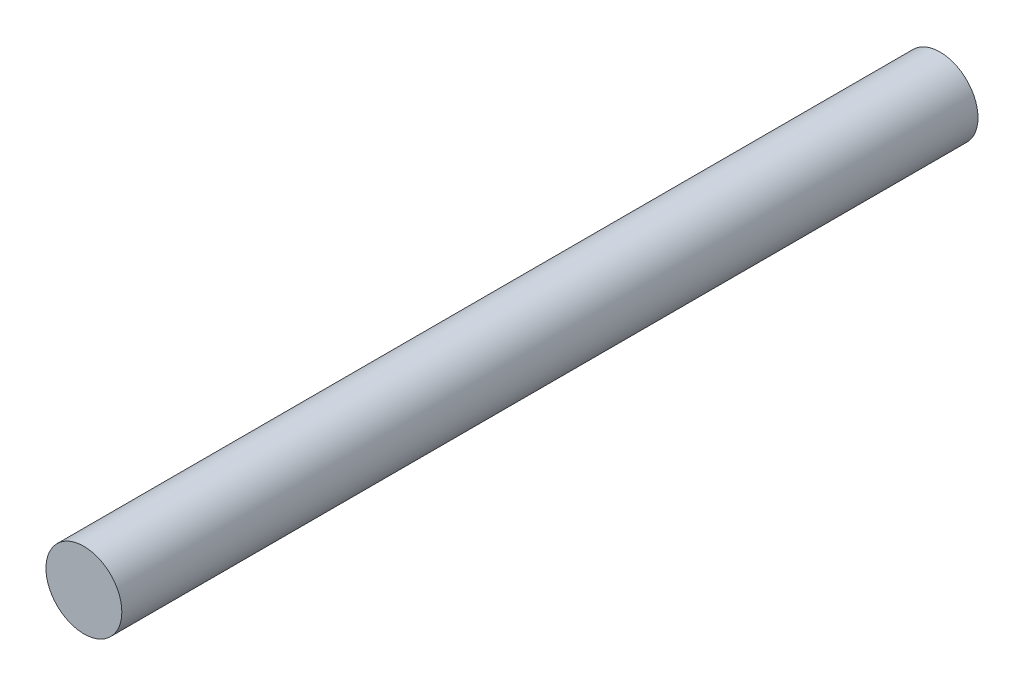
ISO-10303-21;
HEADER;
FILE_DESCRIPTION(('STEP AP214'),'2;1');
FILE_NAME('part.step','',(''),(''),'','','');
FILE_SCHEMA(('AUTOMOTIVE_DESIGN { 1 0 10303 214 1 1 1 1 }'));
ENDSEC;
DATA;
#1=APPLICATION_CONTEXT('core data for automotive mechanical design processes');
#2=APPLICATION_PROTOCOL_DEFINITION('international standard','automotive_design',2000,#1);
#3=PRODUCT_CONTEXT('',#1,'mechanical');
#4=PRODUCT('Part','Part','',(#3));
#5=PRODUCT_RELATED_PRODUCT_CATEGORY('part','',(#4));
#6=PRODUCT_DEFINITION_FORMATION('','',#4);
#7=PRODUCT_DEFINITION_CONTEXT('part definition',#1,'design');
#8=PRODUCT_DEFINITION('design','',#6,#7);
#9=PRODUCT_DEFINITION_SHAPE('','',#8);
#10=(LENGTH_UNIT() NAMED_UNIT(*) SI_UNIT(.MILLI.,.METRE.));
#11=(NAMED_UNIT(*) PLANE_ANGLE_UNIT() SI_UNIT($,.RADIAN.));
#12=(NAMED_UNIT(*) SI_UNIT($,.STERADIAN.) SOLID_ANGLE_UNIT());
#13=UNCERTAINTY_MEASURE_WITH_UNIT(LENGTH_MEASURE(1.E-05),#10,'distance_accuracy_value','');
#14=(GEOMETRIC_REPRESENTATION_CONTEXT(3) GLOBAL_UNCERTAINTY_ASSIGNED_CONTEXT((#13)) GLOBAL_UNIT_ASSIGNED_CONTEXT((#10,
#11,#12)) REPRESENTATION_CONTEXT('',''));
#15=CARTESIAN_POINT('',(0.,0.,0.));
#16=DIRECTION('',(0.,0.,1.));
#17=DIRECTION('',(1.,0.,0.));
#18=AXIS2_PLACEMENT_3D('',#15,#16,#17);
#19=CARTESIAN_POINT('',(0.,0.,38.1));
#20=DIRECTION('',(0.,0.,-1.));
#21=DIRECTION('',(-1.,0.,0.));
#22=AXIS2_PLACEMENT_3D('',#19,#20,#21);
#23=CYLINDRICAL_SURFACE('',#22,3.3782);
#24=CARTESIAN_POINT('',(0.,0.,38.1));
#25=DIRECTION('',(0.,0.,1.));
#26=DIRECTION('',(1.,0.,0.));
#27=AXIS2_PLACEMENT_3D('',#24,#25,#26);
#28=CIRCLE('',#27,3.3782);
#29=CARTESIAN_POINT('',(3.3782,0.,38.1));
#30=VERTEX_POINT('',#29);
#31=EDGE_CURVE('E10',#30,#30,#28,.T.);
#32=ORIENTED_EDGE('',*,*,#31,.F.);
#33=EDGE_LOOP('',(#32));
#34=FACE_BOUND('',#33,.T.);
#35=CARTESIAN_POINT('',(0.,0.,-38.1));
#36=DIRECTION('',(0.,0.,1.));
#37=DIRECTION('',(1.,0.,0.));
#38=AXIS2_PLACEMENT_3D('',#35,#36,#37);
#39=CIRCLE('',#38,3.3782);
#40=CARTESIAN_POINT('',(3.3782,0.,-38.1));
#41=VERTEX_POINT('',#40);
#42=EDGE_CURVE('E40',#41,#41,#39,.T.);
#43=ORIENTED_EDGE('',*,*,#42,.T.);
#44=EDGE_LOOP('',(#43));
#45=FACE_BOUND('',#44,.T.);
#46=ADVANCED_FACE('F37',(#34,#45),#23,.T.);
#47=CARTESIAN_POINT('',(0.,0.,38.1));
#48=DIRECTION('',(0.,0.,1.));
#49=DIRECTION('',(1.,0.,0.));
#50=AXIS2_PLACEMENT_3D('',#47,#48,#49);
#51=PLANE('',#50);
#52=ORIENTED_EDGE('',*,*,#31,.T.);
#53=EDGE_LOOP('',(#52));
#54=FACE_BOUND('',#53,.T.);
#55=ADVANCED_FACE('F54',(#54),#51,.T.);
#56=CARTESIAN_POINT('',(0.,0.,-38.1));
#57=DIRECTION('',(0.,0.,1.));
#58=DIRECTION('',(1.,0.,0.));
#59=AXIS2_PLACEMENT_3D('',#56,#57,#58);
#60=PLANE('',#59);
#61=ORIENTED_EDGE('',*,*,#42,.F.);
#62=EDGE_LOOP('',(#61));
#63=FACE_BOUND('',#62,.T.);
#64=ADVANCED_FACE('F52',(#63),#60,.F.);
#65=CLOSED_SHELL('',(#46,#55,#64));
#66=MANIFOLD_SOLID_BREP('B2',#65);
#67=ADVANCED_BREP_SHAPE_REPRESENTATION('',(#18,#66),#14);
#68=SHAPE_DEFINITION_REPRESENTATION(#9,#67);
ENDSEC;
END-ISO-10303-21;
